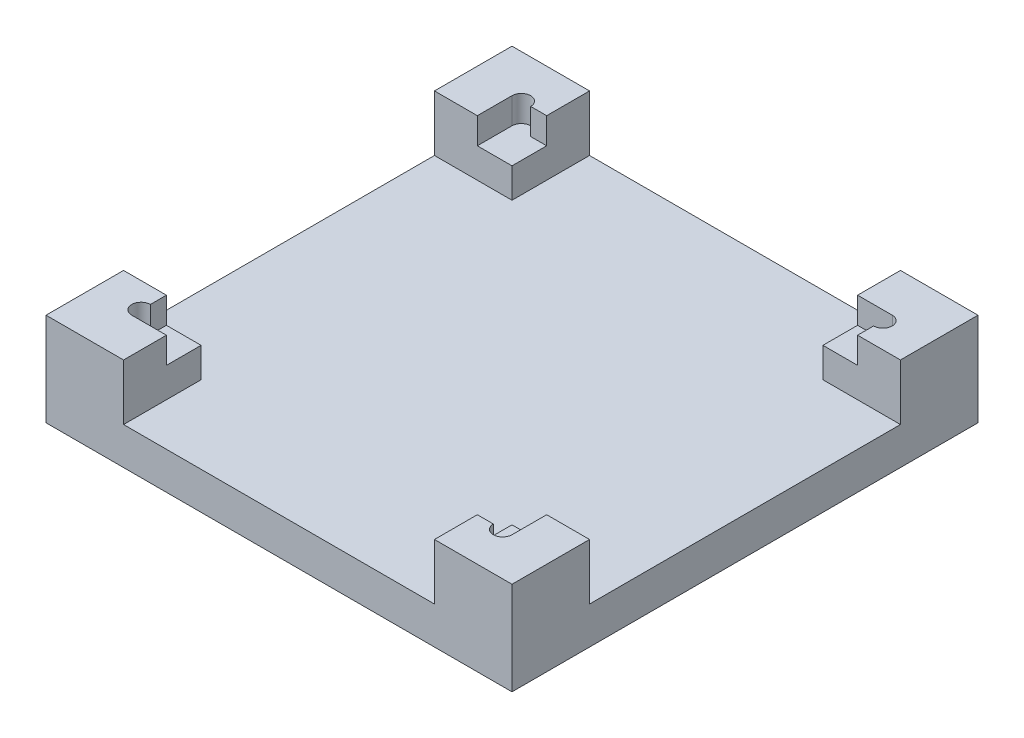
ISO-10303-21;
HEADER;
FILE_DESCRIPTION(('STEP AP214'),'2;1');
FILE_NAME('part.step','',(''),(''),'','','');
FILE_SCHEMA(('AUTOMOTIVE_DESIGN { 1 0 10303 214 1 1 1 1 }'));
ENDSEC;
DATA;
#1=APPLICATION_CONTEXT('core data for automotive mechanical design processes');
#2=APPLICATION_PROTOCOL_DEFINITION('international standard','automotive_design',2000,#1);
#3=PRODUCT_CONTEXT('',#1,'mechanical');
#4=PRODUCT('Part','Part','',(#3));
#5=PRODUCT_RELATED_PRODUCT_CATEGORY('part','',(#4));
#6=PRODUCT_DEFINITION_FORMATION('','',#4);
#7=PRODUCT_DEFINITION_CONTEXT('part definition',#1,'design');
#8=PRODUCT_DEFINITION('design','',#6,#7);
#9=PRODUCT_DEFINITION_SHAPE('','',#8);
#10=(LENGTH_UNIT() NAMED_UNIT(*) SI_UNIT(.MILLI.,.METRE.));
#11=(NAMED_UNIT(*) PLANE_ANGLE_UNIT() SI_UNIT($,.RADIAN.));
#12=(NAMED_UNIT(*) SI_UNIT($,.STERADIAN.) SOLID_ANGLE_UNIT());
#13=UNCERTAINTY_MEASURE_WITH_UNIT(LENGTH_MEASURE(1.E-05),#10,'distance_accuracy_value','');
#14=(GEOMETRIC_REPRESENTATION_CONTEXT(3) GLOBAL_UNCERTAINTY_ASSIGNED_CONTEXT((#13)) GLOBAL_UNIT_ASSIGNED_CONTEXT((#10,
#11,#12)) REPRESENTATION_CONTEXT('',''));
#15=CARTESIAN_POINT('',(0.,0.,0.));
#16=DIRECTION('',(0.,0.,1.));
#17=DIRECTION('',(1.,0.,0.));
#18=AXIS2_PLACEMENT_3D('',#15,#16,#17);
#19=CARTESIAN_POINT('',(0.,10.,0.));
#20=DIRECTION('',(0.,-1.,0.));
#21=DIRECTION('',(0.,0.,-1.));
#22=AXIS2_PLACEMENT_3D('',#19,#20,#21);
#23=PLANE('',#22);
#24=DIRECTION('',(-1.,0.,0.));
#25=VECTOR('',#24,1.);
#26=CARTESIAN_POINT('',(125.,10.,-104.2));
#27=LINE('',#26,#25);
#28=CARTESIAN_POINT('',(125.,10.,-104.2));
#29=VERTEX_POINT('',#28);
#30=CARTESIAN_POINT('',(104.2,10.,-104.2));
#31=VERTEX_POINT('',#30);
#32=EDGE_CURVE('E414',#29,#31,#27,.T.);
#33=ORIENTED_EDGE('',*,*,#32,.T.);
#34=DIRECTION('',(0.,0.,-1.));
#35=VECTOR('',#34,1.);
#36=CARTESIAN_POINT('',(104.2,10.,-125.));
#37=LINE('',#36,#35);
#38=CARTESIAN_POINT('',(104.2,10.,-125.));
#39=VERTEX_POINT('',#38);
#40=EDGE_CURVE('E442',#31,#39,#37,.T.);
#41=ORIENTED_EDGE('',*,*,#40,.T.);
#42=DIRECTION('',(-1.,0.,0.));
#43=VECTOR('',#42,1.);
#44=CARTESIAN_POINT('',(104.2,10.,-125.));
#45=LINE('',#44,#43);
#46=CARTESIAN_POINT('',(20.8,10.,-125.));
#47=VERTEX_POINT('',#46);
#48=EDGE_CURVE('E358',#39,#47,#45,.T.);
#49=ORIENTED_EDGE('',*,*,#48,.T.);
#50=DIRECTION('',(0.,0.,1.));
#51=VECTOR('',#50,1.);
#52=CARTESIAN_POINT('',(20.8,10.,-125.));
#53=LINE('',#52,#51);
#54=CARTESIAN_POINT('',(20.8,10.,-104.2));
#55=VERTEX_POINT('',#54);
#56=EDGE_CURVE('E365',#47,#55,#53,.T.);
#57=ORIENTED_EDGE('',*,*,#56,.T.);
#58=DIRECTION('',(-1.,0.,0.));
#59=VECTOR('',#58,1.);
#60=CARTESIAN_POINT('',(11.5,10.,-104.2));
#61=LINE('',#60,#59);
#62=CARTESIAN_POINT('',(0.,10.,-104.2));
#63=VERTEX_POINT('',#62);
#64=EDGE_CURVE('E55',#55,#63,#61,.T.);
#65=ORIENTED_EDGE('',*,*,#64,.T.);
#66=DIRECTION('',(0.,0.,1.));
#67=VECTOR('',#66,1.);
#68=CARTESIAN_POINT('',(0.,10.,-104.2));
#69=LINE('',#68,#67);
#70=CARTESIAN_POINT('',(0.,10.,-20.8));
#71=VERTEX_POINT('',#70);
#72=EDGE_CURVE('E370',#63,#71,#69,.T.);
#73=ORIENTED_EDGE('',*,*,#72,.T.);
#74=DIRECTION('',(1.,0.,0.));
#75=VECTOR('',#74,1.);
#76=CARTESIAN_POINT('',(11.5,10.,-20.8));
#77=LINE('',#76,#75);
#78=CARTESIAN_POINT('',(20.8,10.,-20.8));
#79=VERTEX_POINT('',#78);
#80=EDGE_CURVE('E373',#71,#79,#77,.T.);
#81=ORIENTED_EDGE('',*,*,#80,.T.);
#82=DIRECTION('',(0.,0.,1.));
#83=VECTOR('',#82,1.);
#84=CARTESIAN_POINT('',(20.8,10.,-11.5));
#85=LINE('',#84,#83);
#86=CARTESIAN_POINT('',(20.8,10.,0.));
#87=VERTEX_POINT('',#86);
#88=EDGE_CURVE('E391',#79,#87,#85,.T.);
#89=ORIENTED_EDGE('',*,*,#88,.T.);
#90=DIRECTION('',(1.,0.,0.));
#91=VECTOR('',#90,1.);
#92=CARTESIAN_POINT('',(104.2,10.,0.));
#93=LINE('',#92,#91);
#94=CARTESIAN_POINT('',(104.2,10.,0.));
#95=VERTEX_POINT('',#94);
#96=EDGE_CURVE('E395',#87,#95,#93,.T.);
#97=ORIENTED_EDGE('',*,*,#96,.T.);
#98=DIRECTION('',(0.,0.,-1.));
#99=VECTOR('',#98,1.);
#100=CARTESIAN_POINT('',(104.2,10.,-11.5));
#101=LINE('',#100,#99);
#102=CARTESIAN_POINT('',(104.2,10.,-20.8));
#103=VERTEX_POINT('',#102);
#104=EDGE_CURVE('E388',#95,#103,#101,.T.);
#105=ORIENTED_EDGE('',*,*,#104,.T.);
#106=DIRECTION('',(1.,0.,0.));
#107=VECTOR('',#106,1.);
#108=CARTESIAN_POINT('',(125.,10.,-20.8));
#109=LINE('',#108,#107);
#110=CARTESIAN_POINT('',(125.,10.,-20.8));
#111=VERTEX_POINT('',#110);
#112=EDGE_CURVE('E416',#103,#111,#109,.T.);
#113=ORIENTED_EDGE('',*,*,#112,.T.);
#114=DIRECTION('',(0.,0.,-1.));
#115=VECTOR('',#114,1.);
#116=CARTESIAN_POINT('',(125.,10.,-104.2));
#117=LINE('',#116,#115);
#118=EDGE_CURVE('E411',#111,#29,#117,.T.);
#119=ORIENTED_EDGE('',*,*,#118,.T.);
#120=EDGE_LOOP('',(#33,#41,#49,#57,#65,#73,#81,#89,#97,#105,#113,#119));
#121=FACE_BOUND('',#120,.T.);
#122=ADVANCED_FACE('F32',(#121),#23,.F.);
#123=CARTESIAN_POINT('',(11.5,10.,-113.5));
#124=DIRECTION('',(0.,0.,-1.));
#125=DIRECTION('',(-1.,0.,0.));
#126=AXIS2_PLACEMENT_3D('',#123,#124,#125);
#127=PLANE('',#126);
#128=DIRECTION('',(-1.,0.,0.));
#129=VECTOR('',#128,1.);
#130=CARTESIAN_POINT('',(113.5,18.,-113.5));
#131=LINE('',#130,#129);
#132=CARTESIAN_POINT('',(113.5,18.,-113.5));
#133=VERTEX_POINT('',#132);
#134=CARTESIAN_POINT('',(104.2,18.,-113.5));
#135=VERTEX_POINT('',#134);
#136=EDGE_CURVE('E493',#133,#135,#131,.T.);
#137=ORIENTED_EDGE('',*,*,#136,.F.);
#138=DIRECTION('',(0.,1.,0.));
#139=VECTOR('',#138,1.);
#140=CARTESIAN_POINT('',(113.5,10.,-113.5));
#141=LINE('',#140,#139);
#142=CARTESIAN_POINT('',(113.5,25.,-113.5));
#143=VERTEX_POINT('',#142);
#144=EDGE_CURVE('E261',#133,#143,#141,.T.);
#145=ORIENTED_EDGE('',*,*,#144,.T.);
#146=DIRECTION('',(-1.,0.,0.));
#147=VECTOR('',#146,1.);
#148=CARTESIAN_POINT('',(11.5,25.,-113.5));
#149=LINE('',#148,#147);
#150=CARTESIAN_POINT('',(104.2,25.,-113.5));
#151=VERTEX_POINT('',#150);
#152=EDGE_CURVE('E272',#143,#151,#149,.T.);
#153=ORIENTED_EDGE('',*,*,#152,.T.);
#154=DIRECTION('',(0.,1.,0.));
#155=VECTOR('',#154,1.);
#156=CARTESIAN_POINT('',(104.2,10.,-113.5));
#157=LINE('',#156,#155);
#158=EDGE_CURVE('E363',#135,#151,#157,.T.);
#159=ORIENTED_EDGE('',*,*,#158,.F.);
#160=EDGE_LOOP('',(#137,#145,#153,#159));
#161=FACE_BOUND('',#160,.T.);
#162=ADVANCED_FACE('F571',(#161),#127,.F.);
#163=CARTESIAN_POINT('',(113.5,10.,-11.5));
#164=DIRECTION('',(1.,0.,0.));
#165=DIRECTION('',(0.,0.,-1.));
#166=AXIS2_PLACEMENT_3D('',#163,#164,#165);
#167=PLANE('',#166);
#168=DIRECTION('',(0.,0.,-1.));
#169=VECTOR('',#168,1.);
#170=CARTESIAN_POINT('',(113.5,25.,-11.5));
#171=LINE('',#170,#169);
#172=CARTESIAN_POINT('',(113.5,25.,-104.2));
#173=VERTEX_POINT('',#172);
#174=CARTESIAN_POINT('',(113.5,25.,-108.5));
#175=VERTEX_POINT('',#174);
#176=EDGE_CURVE('E269',#173,#175,#171,.T.);
#177=ORIENTED_EDGE('',*,*,#176,.T.);
#178=DIRECTION('',(0.,1.,0.));
#179=VECTOR('',#178,1.);
#180=CARTESIAN_POINT('',(113.5,12.4098300562505,-108.5));
#181=LINE('',#180,#179);
#182=CARTESIAN_POINT('',(113.5,18.,-108.5));
#183=VERTEX_POINT('',#182);
#184=EDGE_CURVE('E512',#183,#175,#181,.T.);
#185=ORIENTED_EDGE('',*,*,#184,.F.);
#186=DIRECTION('',(0.,0.,-1.));
#187=VECTOR('',#186,1.);
#188=CARTESIAN_POINT('',(113.5,18.,-113.5));
#189=LINE('',#188,#187);
#190=CARTESIAN_POINT('',(113.5,18.,-104.2));
#191=VERTEX_POINT('',#190);
#192=EDGE_CURVE('E495',#191,#183,#189,.T.);
#193=ORIENTED_EDGE('',*,*,#192,.F.);
#194=DIRECTION('',(0.,1.,0.));
#195=VECTOR('',#194,1.);
#196=CARTESIAN_POINT('',(113.5,10.,-104.2));
#197=LINE('',#196,#195);
#198=EDGE_CURVE('E428',#191,#173,#197,.T.);
#199=ORIENTED_EDGE('',*,*,#198,.T.);
#200=EDGE_LOOP('',(#177,#185,#193,#199));
#201=FACE_BOUND('',#200,.T.);
#202=ADVANCED_FACE('F576',(#201),#167,.F.);
#203=CARTESIAN_POINT('',(11.5,10.,-11.5));
#204=DIRECTION('',(-1.,0.,0.));
#205=DIRECTION('',(0.,0.,1.));
#206=AXIS2_PLACEMENT_3D('',#203,#204,#205);
#207=PLANE('',#206);
#208=DIRECTION('',(0.,0.,1.));
#209=VECTOR('',#208,1.);
#210=CARTESIAN_POINT('',(11.5,25.,-11.5));
#211=LINE('',#210,#209);
#212=CARTESIAN_POINT('',(11.5,25.,-20.8));
#213=VERTEX_POINT('',#212);
#214=CARTESIAN_POINT('',(11.5,25.,-16.5));
#215=VERTEX_POINT('',#214);
#216=EDGE_CURVE('E432',#213,#215,#211,.T.);
#217=ORIENTED_EDGE('',*,*,#216,.T.);
#218=DIRECTION('',(0.,1.,0.));
#219=VECTOR('',#218,1.);
#220=CARTESIAN_POINT('',(11.5,12.4098300562505,-16.5));
#221=LINE('',#220,#219);
#222=CARTESIAN_POINT('',(11.5,18.,-16.5));
#223=VERTEX_POINT('',#222);
#224=EDGE_CURVE('E499',#223,#215,#221,.T.);
#225=ORIENTED_EDGE('',*,*,#224,.F.);
#226=DIRECTION('',(0.,0.,1.));
#227=VECTOR('',#226,1.);
#228=CARTESIAN_POINT('',(11.5,18.,-11.5));
#229=LINE('',#228,#227);
#230=CARTESIAN_POINT('',(11.5,18.,-20.8));
#231=VERTEX_POINT('',#230);
#232=EDGE_CURVE('E470',#231,#223,#229,.T.);
#233=ORIENTED_EDGE('',*,*,#232,.F.);
#234=DIRECTION('',(0.,1.,0.));
#235=VECTOR('',#234,1.);
#236=CARTESIAN_POINT('',(11.5,10.,-20.8));
#237=LINE('',#236,#235);
#238=EDGE_CURVE('E381',#231,#213,#237,.T.);
#239=ORIENTED_EDGE('',*,*,#238,.T.);
#240=EDGE_LOOP('',(#217,#225,#233,#239));
#241=FACE_BOUND('',#240,.T.);
#242=ADVANCED_FACE('F554',(#241),#207,.F.);
#243=CARTESIAN_POINT('',(11.5,10.,-11.5));
#244=DIRECTION('',(0.,0.,1.));
#245=DIRECTION('',(1.,0.,0.));
#246=AXIS2_PLACEMENT_3D('',#243,#244,#245);
#247=PLANE('',#246);
#248=DIRECTION('',(1.,0.,0.));
#249=VECTOR('',#248,1.);
#250=CARTESIAN_POINT('',(11.5,18.,-11.5));
#251=LINE('',#250,#249);
#252=CARTESIAN_POINT('',(11.5,18.,-11.5));
#253=VERTEX_POINT('',#252);
#254=CARTESIAN_POINT('',(20.8,18.,-11.5));
#255=VERTEX_POINT('',#254);
#256=EDGE_CURVE('E467',#253,#255,#251,.T.);
#257=ORIENTED_EDGE('',*,*,#256,.F.);
#258=DIRECTION('',(0.,1.,0.));
#259=VECTOR('',#258,1.);
#260=CARTESIAN_POINT('',(11.5,10.,-11.5));
#261=LINE('',#260,#259);
#262=CARTESIAN_POINT('',(11.5,25.,-11.5));
#263=VERTEX_POINT('',#262);
#264=EDGE_CURVE('E262',#253,#263,#261,.T.);
#265=ORIENTED_EDGE('',*,*,#264,.T.);
#266=DIRECTION('',(1.,0.,0.));
#267=VECTOR('',#266,1.);
#268=CARTESIAN_POINT('',(11.5,25.,-11.5));
#269=LINE('',#268,#267);
#270=CARTESIAN_POINT('',(20.8,25.,-11.5));
#271=VERTEX_POINT('',#270);
#272=EDGE_CURVE('E275',#263,#271,#269,.T.);
#273=ORIENTED_EDGE('',*,*,#272,.T.);
#274=DIRECTION('',(0.,1.,0.));
#275=VECTOR('',#274,1.);
#276=CARTESIAN_POINT('',(20.8,10.,-11.5));
#277=LINE('',#276,#275);
#278=EDGE_CURVE('E408',#255,#271,#277,.T.);
#279=ORIENTED_EDGE('',*,*,#278,.F.);
#280=EDGE_LOOP('',(#257,#265,#273,#279));
#281=FACE_BOUND('',#280,.T.);
#282=ADVANCED_FACE('F547',(#281),#247,.F.);
#283=CARTESIAN_POINT('',(0.,25.,0.));
#284=DIRECTION('',(0.,-1.,0.));
#285=DIRECTION('',(0.,0.,-1.));
#286=AXIS2_PLACEMENT_3D('',#283,#284,#285);
#287=PLANE('',#286);
#288=ORIENTED_EDGE('',*,*,#152,.F.);
#289=CARTESIAN_POINT('',(113.5,25.,-111.));
#290=DIRECTION('',(0.,1.,0.));
#291=DIRECTION('',(0.,0.,-1.));
#292=AXIS2_PLACEMENT_3D('',#289,#290,#291);
#293=CIRCLE('',#292,2.5);
#294=EDGE_CURVE('E511',#175,#143,#293,.T.);
#295=ORIENTED_EDGE('',*,*,#294,.F.);
#296=ORIENTED_EDGE('',*,*,#176,.F.);
#297=DIRECTION('',(-1.,0.,0.));
#298=VECTOR('',#297,1.);
#299=CARTESIAN_POINT('',(125.,25.,-104.2));
#300=LINE('',#299,#298);
#301=CARTESIAN_POINT('',(125.,25.,-104.2));
#302=VERTEX_POINT('',#301);
#303=EDGE_CURVE('E420',#302,#173,#300,.T.);
#304=ORIENTED_EDGE('',*,*,#303,.F.);
#305=DIRECTION('',(0.,0.,-1.));
#306=VECTOR('',#305,1.);
#307=CARTESIAN_POINT('',(125.,25.,0.));
#308=LINE('',#307,#306);
#309=CARTESIAN_POINT('',(125.,25.,-125.));
#310=VERTEX_POINT('',#309);
#311=EDGE_CURVE('E296',#302,#310,#308,.T.);
#312=ORIENTED_EDGE('',*,*,#311,.T.);
#313=DIRECTION('',(-1.,0.,0.));
#314=VECTOR('',#313,1.);
#315=CARTESIAN_POINT('',(0.,25.,-125.));
#316=LINE('',#315,#314);
#317=CARTESIAN_POINT('',(104.2,25.,-125.));
#318=VERTEX_POINT('',#317);
#319=EDGE_CURVE('E300',#310,#318,#316,.T.);
#320=ORIENTED_EDGE('',*,*,#319,.T.);
#321=DIRECTION('',(0.,0.,-1.));
#322=VECTOR('',#321,1.);
#323=CARTESIAN_POINT('',(104.2,25.,-125.));
#324=LINE('',#323,#322);
#325=EDGE_CURVE('E383',#151,#318,#324,.T.);
#326=ORIENTED_EDGE('',*,*,#325,.F.);
#327=EDGE_LOOP('',(#288,#295,#296,#304,#312,#320,#326));
#328=FACE_BOUND('',#327,.T.);
#329=ADVANCED_FACE('F593',(#328),#287,.F.);
#330=ORIENTED_EDGE('',*,*,#272,.F.);
#331=CARTESIAN_POINT('',(11.5,25.,-14.));
#332=DIRECTION('',(0.,1.,0.));
#333=DIRECTION('',(0.,0.,-1.));
#334=AXIS2_PLACEMENT_3D('',#331,#332,#333);
#335=CIRCLE('',#334,2.5);
#336=EDGE_CURVE('E501',#215,#263,#335,.T.);
#337=ORIENTED_EDGE('',*,*,#336,.F.);
#338=ORIENTED_EDGE('',*,*,#216,.F.);
#339=DIRECTION('',(1.,0.,0.));
#340=VECTOR('',#339,1.);
#341=CARTESIAN_POINT('',(11.5,25.,-20.8));
#342=LINE('',#341,#340);
#343=CARTESIAN_POINT('',(0.,25.,-20.8));
#344=VERTEX_POINT('',#343);
#345=EDGE_CURVE('E371',#344,#213,#342,.T.);
#346=ORIENTED_EDGE('',*,*,#345,.F.);
#347=DIRECTION('',(0.,0.,1.));
#348=VECTOR('',#347,1.);
#349=CARTESIAN_POINT('',(0.,25.,0.));
#350=LINE('',#349,#348);
#351=CARTESIAN_POINT('',(0.,25.,0.));
#352=VERTEX_POINT('',#351);
#353=EDGE_CURVE('E292',#344,#352,#350,.T.);
#354=ORIENTED_EDGE('',*,*,#353,.T.);
#355=DIRECTION('',(1.,0.,0.));
#356=VECTOR('',#355,1.);
#357=CARTESIAN_POINT('',(0.,25.,0.));
#358=LINE('',#357,#356);
#359=CARTESIAN_POINT('',(20.8,25.,0.));
#360=VERTEX_POINT('',#359);
#361=EDGE_CURVE('E293',#352,#360,#358,.T.);
#362=ORIENTED_EDGE('',*,*,#361,.T.);
#363=DIRECTION('',(0.,0.,1.));
#364=VECTOR('',#363,1.);
#365=CARTESIAN_POINT('',(20.8,25.,-11.5));
#366=LINE('',#365,#364);
#367=EDGE_CURVE('E392',#271,#360,#366,.T.);
#368=ORIENTED_EDGE('',*,*,#367,.F.);
#369=EDGE_LOOP('',(#330,#337,#338,#346,#354,#362,#368));
#370=FACE_BOUND('',#369,.T.);
#371=ADVANCED_FACE('F543',(#370),#287,.F.);
#372=CARTESIAN_POINT('',(113.5,25.,-11.5));
#373=VERTEX_POINT('',#372);
#374=CARTESIAN_POINT('',(113.5,25.,-20.8));
#375=VERTEX_POINT('',#374);
#376=EDGE_CURVE('E258',#373,#375,#171,.T.);
#377=ORIENTED_EDGE('',*,*,#376,.F.);
#378=CARTESIAN_POINT('',(111.,25.,-11.5));
#379=DIRECTION('',(0.,1.,0.));
#380=DIRECTION('',(0.,0.,-1.));
#381=AXIS2_PLACEMENT_3D('',#378,#379,#380);
#382=CIRCLE('',#381,2.5);
#383=CARTESIAN_POINT('',(108.5,25.,-11.5));
#384=VERTEX_POINT('',#383);
#385=EDGE_CURVE('E241',#384,#373,#382,.T.);
#386=ORIENTED_EDGE('',*,*,#385,.F.);
#387=CARTESIAN_POINT('',(104.2,25.,-11.5));
#388=VERTEX_POINT('',#387);
#389=EDGE_CURVE('E431',#388,#384,#269,.T.);
#390=ORIENTED_EDGE('',*,*,#389,.F.);
#391=DIRECTION('',(0.,0.,-1.));
#392=VECTOR('',#391,1.);
#393=CARTESIAN_POINT('',(104.2,25.,-11.5));
#394=LINE('',#393,#392);
#395=CARTESIAN_POINT('',(104.2,25.,0.));
#396=VERTEX_POINT('',#395);
#397=EDGE_CURVE('E399',#396,#388,#394,.T.);
#398=ORIENTED_EDGE('',*,*,#397,.F.);
#399=CARTESIAN_POINT('',(125.,25.,0.));
#400=VERTEX_POINT('',#399);
#401=EDGE_CURVE('E291',#396,#400,#358,.T.);
#402=ORIENTED_EDGE('',*,*,#401,.T.);
#403=CARTESIAN_POINT('',(125.,25.,-20.8));
#404=VERTEX_POINT('',#403);
#405=EDGE_CURVE('E297',#400,#404,#308,.T.);
#406=ORIENTED_EDGE('',*,*,#405,.T.);
#407=DIRECTION('',(1.,0.,0.));
#408=VECTOR('',#407,1.);
#409=CARTESIAN_POINT('',(125.,25.,-20.8));
#410=LINE('',#409,#408);
#411=EDGE_CURVE('E267',#375,#404,#410,.T.);
#412=ORIENTED_EDGE('',*,*,#411,.F.);
#413=EDGE_LOOP('',(#377,#386,#390,#398,#402,#406,#412));
#414=FACE_BOUND('',#413,.T.);
#415=ADVANCED_FACE('F265',(#414),#287,.F.);
#416=DIRECTION('',(0.,1.,0.));
#417=VECTOR('',#416,1.);
#418=CARTESIAN_POINT('',(113.5,10.,-20.8));
#419=LINE('',#418,#417);
#420=CARTESIAN_POINT('',(113.5,18.,-20.8));
#421=VERTEX_POINT('',#420);
#422=EDGE_CURVE('E426',#421,#375,#419,.T.);
#423=ORIENTED_EDGE('',*,*,#422,.F.);
#424=DIRECTION('',(0.,0.,-1.));
#425=VECTOR('',#424,1.);
#426=CARTESIAN_POINT('',(113.5,18.,-11.5));
#427=LINE('',#426,#425);
#428=CARTESIAN_POINT('',(113.5,18.,-11.5));
#429=VERTEX_POINT('',#428);
#430=EDGE_CURVE('E260',#429,#421,#427,.T.);
#431=ORIENTED_EDGE('',*,*,#430,.F.);
#432=DIRECTION('',(0.,1.,0.));
#433=VECTOR('',#432,1.);
#434=CARTESIAN_POINT('',(113.5,10.,-11.5));
#435=LINE('',#434,#433);
#436=EDGE_CURVE('E244',#429,#373,#435,.T.);
#437=ORIENTED_EDGE('',*,*,#436,.T.);
#438=ORIENTED_EDGE('',*,*,#376,.T.);
#439=EDGE_LOOP('',(#423,#431,#437,#438));
#440=FACE_BOUND('',#439,.T.);
#441=ADVANCED_FACE('F257',(#440),#167,.F.);
#442=ORIENTED_EDGE('',*,*,#389,.T.);
#443=DIRECTION('',(0.,1.,0.));
#444=VECTOR('',#443,1.);
#445=CARTESIAN_POINT('',(108.5,12.4098300562505,-11.5));
#446=LINE('',#445,#444);
#447=CARTESIAN_POINT('',(108.5,18.,-11.5));
#448=VERTEX_POINT('',#447);
#449=EDGE_CURVE('E247',#448,#384,#446,.T.);
#450=ORIENTED_EDGE('',*,*,#449,.F.);
#451=DIRECTION('',(1.,0.,0.));
#452=VECTOR('',#451,1.);
#453=CARTESIAN_POINT('',(113.5,18.,-11.5));
#454=LINE('',#453,#452);
#455=CARTESIAN_POINT('',(104.2,18.,-11.5));
#456=VERTEX_POINT('',#455);
#457=EDGE_CURVE('E450',#456,#448,#454,.T.);
#458=ORIENTED_EDGE('',*,*,#457,.F.);
#459=DIRECTION('',(0.,1.,0.));
#460=VECTOR('',#459,1.);
#461=CARTESIAN_POINT('',(104.2,10.,-11.5));
#462=LINE('',#461,#460);
#463=EDGE_CURVE('E398',#456,#388,#462,.T.);
#464=ORIENTED_EDGE('',*,*,#463,.T.);
#465=EDGE_LOOP('',(#442,#450,#458,#464));
#466=FACE_BOUND('',#465,.T.);
#467=ADVANCED_FACE('F520',(#466),#247,.F.);
#468=CARTESIAN_POINT('',(0.,25.,0.));
#469=DIRECTION('',(1.,0.,0.));
#470=DIRECTION('',(0.,0.,-1.));
#471=AXIS2_PLACEMENT_3D('',#468,#469,#470);
#472=PLANE('',#471);
#473=ORIENTED_EDGE('',*,*,#353,.F.);
#474=DIRECTION('',(0.,1.,0.));
#475=VECTOR('',#474,1.);
#476=CARTESIAN_POINT('',(0.,10.,-20.8));
#477=LINE('',#476,#475);
#478=EDGE_CURVE('E384',#71,#344,#477,.T.);
#479=ORIENTED_EDGE('',*,*,#478,.F.);
#480=ORIENTED_EDGE('',*,*,#72,.F.);
#481=DIRECTION('',(0.,1.,0.));
#482=VECTOR('',#481,1.);
#483=CARTESIAN_POINT('',(0.,10.,-104.2));
#484=LINE('',#483,#482);
#485=CARTESIAN_POINT('',(0.,25.,-104.2));
#486=VERTEX_POINT('',#485);
#487=EDGE_CURVE('E343',#63,#486,#484,.T.);
#488=ORIENTED_EDGE('',*,*,#487,.T.);
#489=CARTESIAN_POINT('',(0.,25.,-125.));
#490=VERTEX_POINT('',#489);
#491=EDGE_CURVE('E288',#490,#486,#350,.T.);
#492=ORIENTED_EDGE('',*,*,#491,.F.);
#493=DIRECTION('',(0.,-1.,0.));
#494=VECTOR('',#493,1.);
#495=CARTESIAN_POINT('',(0.,25.,-125.));
#496=LINE('',#495,#494);
#497=CARTESIAN_POINT('',(0.,0.,-125.));
#498=VERTEX_POINT('',#497);
#499=EDGE_CURVE('E303',#490,#498,#496,.T.);
#500=ORIENTED_EDGE('',*,*,#499,.T.);
#501=DIRECTION('',(0.,0.,1.));
#502=VECTOR('',#501,1.);
#503=CARTESIAN_POINT('',(0.,0.,0.));
#504=LINE('',#503,#502);
#505=CARTESIAN_POINT('',(0.,0.,0.));
#506=VERTEX_POINT('',#505);
#507=EDGE_CURVE('E283',#498,#506,#504,.T.);
#508=ORIENTED_EDGE('',*,*,#507,.T.);
#509=DIRECTION('',(0.,-1.,0.));
#510=VECTOR('',#509,1.);
#511=CARTESIAN_POINT('',(0.,25.,0.));
#512=LINE('',#511,#510);
#513=EDGE_CURVE('E11',#352,#506,#512,.T.);
#514=ORIENTED_EDGE('',*,*,#513,.F.);
#515=EDGE_LOOP('',(#473,#479,#480,#488,#492,#500,#508,#514));
#516=FACE_BOUND('',#515,.T.);
#517=ADVANCED_FACE('F34',(#516),#472,.F.);
#518=CARTESIAN_POINT('',(0.,25.,0.));
#519=DIRECTION('',(0.,0.,-1.));
#520=DIRECTION('',(-1.,0.,0.));
#521=AXIS2_PLACEMENT_3D('',#518,#519,#520);
#522=PLANE('',#521);
#523=ORIENTED_EDGE('',*,*,#401,.F.);
#524=DIRECTION('',(0.,1.,0.));
#525=VECTOR('',#524,1.);
#526=CARTESIAN_POINT('',(104.2,10.,0.));
#527=LINE('',#526,#525);
#528=EDGE_CURVE('E378',#95,#396,#527,.T.);
#529=ORIENTED_EDGE('',*,*,#528,.F.);
#530=ORIENTED_EDGE('',*,*,#96,.F.);
#531=DIRECTION('',(0.,1.,0.));
#532=VECTOR('',#531,1.);
#533=CARTESIAN_POINT('',(20.8,10.,0.));
#534=LINE('',#533,#532);
#535=EDGE_CURVE('E405',#87,#360,#534,.T.);
#536=ORIENTED_EDGE('',*,*,#535,.T.);
#537=ORIENTED_EDGE('',*,*,#361,.F.);
#538=ORIENTED_EDGE('',*,*,#513,.T.);
#539=DIRECTION('',(1.,0.,0.));
#540=VECTOR('',#539,1.);
#541=CARTESIAN_POINT('',(0.,0.,0.));
#542=LINE('',#541,#540);
#543=CARTESIAN_POINT('',(125.,0.,0.));
#544=VERTEX_POINT('',#543);
#545=EDGE_CURVE('E306',#506,#544,#542,.T.);
#546=ORIENTED_EDGE('',*,*,#545,.T.);
#547=DIRECTION('',(0.,-1.,0.));
#548=VECTOR('',#547,1.);
#549=CARTESIAN_POINT('',(125.,25.,0.));
#550=LINE('',#549,#548);
#551=EDGE_CURVE('E40',#400,#544,#550,.T.);
#552=ORIENTED_EDGE('',*,*,#551,.F.);
#553=EDGE_LOOP('',(#523,#529,#530,#536,#537,#538,#546,#552));
#554=FACE_BOUND('',#553,.T.);
#555=ADVANCED_FACE('F529',(#554),#522,.F.);
#556=CARTESIAN_POINT('',(125.,25.,0.));
#557=DIRECTION('',(-1.,0.,0.));
#558=DIRECTION('',(0.,0.,1.));
#559=AXIS2_PLACEMENT_3D('',#556,#557,#558);
#560=PLANE('',#559);
#561=ORIENTED_EDGE('',*,*,#118,.F.);
#562=DIRECTION('',(0.,1.,0.));
#563=VECTOR('',#562,1.);
#564=CARTESIAN_POINT('',(125.,10.,-20.8));
#565=LINE('',#564,#563);
#566=EDGE_CURVE('E402',#111,#404,#565,.T.);
#567=ORIENTED_EDGE('',*,*,#566,.T.);
#568=ORIENTED_EDGE('',*,*,#405,.F.);
#569=ORIENTED_EDGE('',*,*,#551,.T.);
#570=DIRECTION('',(0.,0.,-1.));
#571=VECTOR('',#570,1.);
#572=CARTESIAN_POINT('',(125.,0.,0.));
#573=LINE('',#572,#571);
#574=CARTESIAN_POINT('',(125.,0.,-125.));
#575=VERTEX_POINT('',#574);
#576=EDGE_CURVE('E308',#544,#575,#573,.T.);
#577=ORIENTED_EDGE('',*,*,#576,.T.);
#578=DIRECTION('',(0.,-1.,0.));
#579=VECTOR('',#578,1.);
#580=CARTESIAN_POINT('',(125.,25.,-125.));
#581=LINE('',#580,#579);
#582=EDGE_CURVE('E314',#310,#575,#581,.T.);
#583=ORIENTED_EDGE('',*,*,#582,.F.);
#584=ORIENTED_EDGE('',*,*,#311,.F.);
#585=DIRECTION('',(0.,1.,0.));
#586=VECTOR('',#585,1.);
#587=CARTESIAN_POINT('',(125.,10.,-104.2));
#588=LINE('',#587,#586);
#589=EDGE_CURVE('E419',#29,#302,#588,.T.);
#590=ORIENTED_EDGE('',*,*,#589,.F.);
#591=EDGE_LOOP('',(#561,#567,#568,#569,#577,#583,#584,#590));
#592=FACE_BOUND('',#591,.T.);
#593=ADVANCED_FACE('F322',(#592),#560,.F.);
#594=CARTESIAN_POINT('',(0.,25.,-125.));
#595=DIRECTION('',(0.,0.,1.));
#596=DIRECTION('',(1.,0.,0.));
#597=AXIS2_PLACEMENT_3D('',#594,#595,#596);
#598=PLANE('',#597);
#599=ORIENTED_EDGE('',*,*,#48,.F.);
#600=DIRECTION('',(0.,1.,0.));
#601=VECTOR('',#600,1.);
#602=CARTESIAN_POINT('',(104.2,10.,-125.));
#603=LINE('',#602,#601);
#604=EDGE_CURVE('E361',#39,#318,#603,.T.);
#605=ORIENTED_EDGE('',*,*,#604,.T.);
#606=ORIENTED_EDGE('',*,*,#319,.F.);
#607=ORIENTED_EDGE('',*,*,#582,.T.);
#608=DIRECTION('',(-1.,0.,0.));
#609=VECTOR('',#608,1.);
#610=CARTESIAN_POINT('',(0.,0.,-125.));
#611=LINE('',#610,#609);
#612=EDGE_CURVE('E310',#575,#498,#611,.T.);
#613=ORIENTED_EDGE('',*,*,#612,.T.);
#614=ORIENTED_EDGE('',*,*,#499,.F.);
#615=CARTESIAN_POINT('',(20.8,25.,-125.));
#616=VERTEX_POINT('',#615);
#617=EDGE_CURVE('E299',#616,#490,#316,.T.);
#618=ORIENTED_EDGE('',*,*,#617,.F.);
#619=DIRECTION('',(0.,1.,0.));
#620=VECTOR('',#619,1.);
#621=CARTESIAN_POINT('',(20.8,10.,-125.));
#622=LINE('',#621,#620);
#623=EDGE_CURVE('E355',#47,#616,#622,.T.);
#624=ORIENTED_EDGE('',*,*,#623,.F.);
#625=EDGE_LOOP('',(#599,#605,#606,#607,#613,#614,#618,#624));
#626=FACE_BOUND('',#625,.T.);
#627=ADVANCED_FACE('F334',(#626),#598,.F.);
#628=CARTESIAN_POINT('',(11.5,25.,-113.5));
#629=VERTEX_POINT('',#628);
#630=CARTESIAN_POINT('',(11.5,25.,-104.2));
#631=VERTEX_POINT('',#630);
#632=EDGE_CURVE('E430',#629,#631,#211,.T.);
#633=ORIENTED_EDGE('',*,*,#632,.F.);
#634=CARTESIAN_POINT('',(14.,25.,-113.5));
#635=DIRECTION('',(0.,1.,0.));
#636=DIRECTION('',(0.,0.,-1.));
#637=AXIS2_PLACEMENT_3D('',#634,#635,#636);
#638=CIRCLE('',#637,2.5);
#639=CARTESIAN_POINT('',(16.5,25.,-113.5));
#640=VERTEX_POINT('',#639);
#641=EDGE_CURVE('E508',#640,#629,#638,.T.);
#642=ORIENTED_EDGE('',*,*,#641,.F.);
#643=CARTESIAN_POINT('',(20.8,25.,-113.5));
#644=VERTEX_POINT('',#643);
#645=EDGE_CURVE('E268',#644,#640,#149,.T.);
#646=ORIENTED_EDGE('',*,*,#645,.F.);
#647=DIRECTION('',(0.,0.,1.));
#648=VECTOR('',#647,1.);
#649=CARTESIAN_POINT('',(20.8,25.,-125.));
#650=LINE('',#649,#648);
#651=EDGE_CURVE('E353',#616,#644,#650,.T.);
#652=ORIENTED_EDGE('',*,*,#651,.F.);
#653=ORIENTED_EDGE('',*,*,#617,.T.);
#654=ORIENTED_EDGE('',*,*,#491,.T.);
#655=DIRECTION('',(-1.,0.,0.));
#656=VECTOR('',#655,1.);
#657=CARTESIAN_POINT('',(11.5,25.,-104.2));
#658=LINE('',#657,#656);
#659=EDGE_CURVE('E348',#631,#486,#658,.T.);
#660=ORIENTED_EDGE('',*,*,#659,.F.);
#661=EDGE_LOOP('',(#633,#642,#646,#652,#653,#654,#660));
#662=FACE_BOUND('',#661,.T.);
#663=ADVANCED_FACE('F347',(#662),#287,.F.);
#664=CARTESIAN_POINT('',(0.,0.,0.));
#665=DIRECTION('',(0.,-1.,0.));
#666=DIRECTION('',(0.,0.,-1.));
#667=AXIS2_PLACEMENT_3D('',#664,#665,#666);
#668=PLANE('',#667);
#669=ORIENTED_EDGE('',*,*,#507,.F.);
#670=ORIENTED_EDGE('',*,*,#612,.F.);
#671=ORIENTED_EDGE('',*,*,#576,.F.);
#672=ORIENTED_EDGE('',*,*,#545,.F.);
#673=EDGE_LOOP('',(#669,#670,#671,#672));
#674=FACE_BOUND('',#673,.T.);
#675=ADVANCED_FACE('F330',(#674),#668,.T.);
#676=DIRECTION('',(0.,1.,0.));
#677=VECTOR('',#676,1.);
#678=CARTESIAN_POINT('',(11.5,10.,-104.2));
#679=LINE('',#678,#677);
#680=CARTESIAN_POINT('',(11.5,18.,-104.2));
#681=VERTEX_POINT('',#680);
#682=EDGE_CURVE('E376',#681,#631,#679,.T.);
#683=ORIENTED_EDGE('',*,*,#682,.F.);
#684=DIRECTION('',(0.,0.,1.));
#685=VECTOR('',#684,1.);
#686=CARTESIAN_POINT('',(11.5,18.,-113.5));
#687=LINE('',#686,#685);
#688=CARTESIAN_POINT('',(11.5,18.,-113.5));
#689=VERTEX_POINT('',#688);
#690=EDGE_CURVE('E484',#689,#681,#687,.T.);
#691=ORIENTED_EDGE('',*,*,#690,.F.);
#692=DIRECTION('',(0.,1.,0.));
#693=VECTOR('',#692,1.);
#694=CARTESIAN_POINT('',(11.5,10.,-113.5));
#695=LINE('',#694,#693);
#696=EDGE_CURVE('E280',#689,#629,#695,.T.);
#697=ORIENTED_EDGE('',*,*,#696,.T.);
#698=ORIENTED_EDGE('',*,*,#632,.T.);
#699=EDGE_LOOP('',(#683,#691,#697,#698));
#700=FACE_BOUND('',#699,.T.);
#701=ADVANCED_FACE('F586',(#700),#207,.F.);
#702=ORIENTED_EDGE('',*,*,#645,.T.);
#703=DIRECTION('',(0.,1.,0.));
#704=VECTOR('',#703,1.);
#705=CARTESIAN_POINT('',(16.5,12.4098300562505,-113.5));
#706=LINE('',#705,#704);
#707=CARTESIAN_POINT('',(16.5,18.,-113.5));
#708=VERTEX_POINT('',#707);
#709=EDGE_CURVE('E505',#708,#640,#706,.T.);
#710=ORIENTED_EDGE('',*,*,#709,.F.);
#711=DIRECTION('',(-1.,0.,0.));
#712=VECTOR('',#711,1.);
#713=CARTESIAN_POINT('',(11.5,18.,-113.5));
#714=LINE('',#713,#712);
#715=CARTESIAN_POINT('',(20.8,18.,-113.5));
#716=VERTEX_POINT('',#715);
#717=EDGE_CURVE('E476',#716,#708,#714,.T.);
#718=ORIENTED_EDGE('',*,*,#717,.F.);
#719=DIRECTION('',(0.,1.,0.));
#720=VECTOR('',#719,1.);
#721=CARTESIAN_POINT('',(20.8,10.,-113.5));
#722=LINE('',#721,#720);
#723=EDGE_CURVE('E360',#716,#644,#722,.T.);
#724=ORIENTED_EDGE('',*,*,#723,.T.);
#725=EDGE_LOOP('',(#702,#710,#718,#724));
#726=FACE_BOUND('',#725,.T.);
#727=ADVANCED_FACE('F579',(#726),#127,.F.);
#728=CARTESIAN_POINT('',(125.,10.,-20.8));
#729=DIRECTION('',(0.,0.,1.));
#730=DIRECTION('',(1.,0.,0.));
#731=AXIS2_PLACEMENT_3D('',#728,#729,#730);
#732=PLANE('',#731);
#733=ORIENTED_EDGE('',*,*,#411,.T.);
#734=ORIENTED_EDGE('',*,*,#566,.F.);
#735=ORIENTED_EDGE('',*,*,#112,.F.);
#736=DIRECTION('',(0.,-1.,0.));
#737=VECTOR('',#736,1.);
#738=CARTESIAN_POINT('',(104.2,18.,-20.8));
#739=LINE('',#738,#737);
#740=CARTESIAN_POINT('',(104.2,18.,-20.8));
#741=VERTEX_POINT('',#740);
#742=EDGE_CURVE('E423',#741,#103,#739,.T.);
#743=ORIENTED_EDGE('',*,*,#742,.F.);
#744=DIRECTION('',(-1.,0.,0.));
#745=VECTOR('',#744,1.);
#746=CARTESIAN_POINT('',(113.5,18.,-20.8));
#747=LINE('',#746,#745);
#748=EDGE_CURVE('E456',#421,#741,#747,.T.);
#749=ORIENTED_EDGE('',*,*,#748,.F.);
#750=ORIENTED_EDGE('',*,*,#422,.T.);
#751=EDGE_LOOP('',(#733,#734,#735,#743,#749,#750));
#752=FACE_BOUND('',#751,.T.);
#753=ADVANCED_FACE('F585',(#752),#732,.F.);
#754=CARTESIAN_POINT('',(125.,10.,-104.2));
#755=DIRECTION('',(0.,0.,-1.));
#756=DIRECTION('',(-1.,0.,0.));
#757=AXIS2_PLACEMENT_3D('',#754,#755,#756);
#758=PLANE('',#757);
#759=ORIENTED_EDGE('',*,*,#303,.T.);
#760=ORIENTED_EDGE('',*,*,#198,.F.);
#761=DIRECTION('',(1.,0.,0.));
#762=VECTOR('',#761,1.);
#763=CARTESIAN_POINT('',(113.5,18.,-104.2));
#764=LINE('',#763,#762);
#765=CARTESIAN_POINT('',(104.2,18.,-104.2));
#766=VERTEX_POINT('',#765);
#767=EDGE_CURVE('E490',#766,#191,#764,.T.);
#768=ORIENTED_EDGE('',*,*,#767,.F.);
#769=DIRECTION('',(0.,-1.,0.));
#770=VECTOR('',#769,1.);
#771=CARTESIAN_POINT('',(104.2,18.,-104.2));
#772=LINE('',#771,#770);
#773=EDGE_CURVE('E487',#766,#31,#772,.T.);
#774=ORIENTED_EDGE('',*,*,#773,.T.);
#775=ORIENTED_EDGE('',*,*,#32,.F.);
#776=ORIENTED_EDGE('',*,*,#589,.T.);
#777=EDGE_LOOP('',(#759,#760,#768,#774,#775,#776));
#778=FACE_BOUND('',#777,.T.);
#779=ADVANCED_FACE('F581',(#778),#758,.F.);
#780=CARTESIAN_POINT('',(104.2,10.,-11.5));
#781=DIRECTION('',(1.,0.,0.));
#782=DIRECTION('',(0.,0.,-1.));
#783=AXIS2_PLACEMENT_3D('',#780,#781,#782);
#784=PLANE('',#783);
#785=ORIENTED_EDGE('',*,*,#397,.T.);
#786=ORIENTED_EDGE('',*,*,#463,.F.);
#787=DIRECTION('',(0.,0.,1.));
#788=VECTOR('',#787,1.);
#789=CARTESIAN_POINT('',(104.2,18.,-11.5));
#790=LINE('',#789,#788);
#791=EDGE_CURVE('E453',#741,#456,#790,.T.);
#792=ORIENTED_EDGE('',*,*,#791,.F.);
#793=ORIENTED_EDGE('',*,*,#742,.T.);
#794=ORIENTED_EDGE('',*,*,#104,.F.);
#795=ORIENTED_EDGE('',*,*,#528,.T.);
#796=EDGE_LOOP('',(#785,#786,#792,#793,#794,#795));
#797=FACE_BOUND('',#796,.T.);
#798=ADVANCED_FACE('F526',(#797),#784,.F.);
#799=CARTESIAN_POINT('',(20.8,10.,-11.5));
#800=DIRECTION('',(-1.,0.,0.));
#801=DIRECTION('',(0.,0.,1.));
#802=AXIS2_PLACEMENT_3D('',#799,#800,#801);
#803=PLANE('',#802);
#804=ORIENTED_EDGE('',*,*,#367,.T.);
#805=ORIENTED_EDGE('',*,*,#535,.F.);
#806=ORIENTED_EDGE('',*,*,#88,.F.);
#807=DIRECTION('',(0.,-1.,0.));
#808=VECTOR('',#807,1.);
#809=CARTESIAN_POINT('',(20.8,18.,-20.8));
#810=LINE('',#809,#808);
#811=CARTESIAN_POINT('',(20.8,18.,-20.8));
#812=VERTEX_POINT('',#811);
#813=EDGE_CURVE('E459',#812,#79,#810,.T.);
#814=ORIENTED_EDGE('',*,*,#813,.F.);
#815=DIRECTION('',(0.,0.,-1.));
#816=VECTOR('',#815,1.);
#817=CARTESIAN_POINT('',(20.8,18.,-11.5));
#818=LINE('',#817,#816);
#819=EDGE_CURVE('E465',#255,#812,#818,.T.);
#820=ORIENTED_EDGE('',*,*,#819,.F.);
#821=ORIENTED_EDGE('',*,*,#278,.T.);
#822=EDGE_LOOP('',(#804,#805,#806,#814,#820,#821));
#823=FACE_BOUND('',#822,.T.);
#824=ADVANCED_FACE('F536',(#823),#803,.F.);
#825=CARTESIAN_POINT('',(11.5,10.,-20.8));
#826=DIRECTION('',(0.,0.,1.));
#827=DIRECTION('',(1.,0.,0.));
#828=AXIS2_PLACEMENT_3D('',#825,#826,#827);
#829=PLANE('',#828);
#830=ORIENTED_EDGE('',*,*,#345,.T.);
#831=ORIENTED_EDGE('',*,*,#238,.F.);
#832=DIRECTION('',(-1.,0.,0.));
#833=VECTOR('',#832,1.);
#834=CARTESIAN_POINT('',(11.5,18.,-20.8));
#835=LINE('',#834,#833);
#836=EDGE_CURVE('E462',#812,#231,#835,.T.);
#837=ORIENTED_EDGE('',*,*,#836,.F.);
#838=ORIENTED_EDGE('',*,*,#813,.T.);
#839=ORIENTED_EDGE('',*,*,#80,.F.);
#840=ORIENTED_EDGE('',*,*,#478,.T.);
#841=EDGE_LOOP('',(#830,#831,#837,#838,#839,#840));
#842=FACE_BOUND('',#841,.T.);
#843=ADVANCED_FACE('F558',(#842),#829,.F.);
#844=CARTESIAN_POINT('',(11.5,10.,-104.2));
#845=DIRECTION('',(0.,0.,-1.));
#846=DIRECTION('',(-1.,0.,0.));
#847=AXIS2_PLACEMENT_3D('',#844,#845,#846);
#848=PLANE('',#847);
#849=ORIENTED_EDGE('',*,*,#659,.T.);
#850=ORIENTED_EDGE('',*,*,#487,.F.);
#851=ORIENTED_EDGE('',*,*,#64,.F.);
#852=DIRECTION('',(0.,-1.,0.));
#853=VECTOR('',#852,1.);
#854=CARTESIAN_POINT('',(20.8,18.,-104.2));
#855=LINE('',#854,#853);
#856=CARTESIAN_POINT('',(20.8,18.,-104.2));
#857=VERTEX_POINT('',#856);
#858=EDGE_CURVE('E473',#857,#55,#855,.T.);
#859=ORIENTED_EDGE('',*,*,#858,.F.);
#860=DIRECTION('',(1.,0.,0.));
#861=VECTOR('',#860,1.);
#862=CARTESIAN_POINT('',(11.5,18.,-104.2));
#863=LINE('',#862,#861);
#864=EDGE_CURVE('E482',#681,#857,#863,.T.);
#865=ORIENTED_EDGE('',*,*,#864,.F.);
#866=ORIENTED_EDGE('',*,*,#682,.T.);
#867=EDGE_LOOP('',(#849,#850,#851,#859,#865,#866));
#868=FACE_BOUND('',#867,.T.);
#869=ADVANCED_FACE('F560',(#868),#848,.F.);
#870=CARTESIAN_POINT('',(104.2,10.,-125.));
#871=DIRECTION('',(1.,0.,0.));
#872=DIRECTION('',(0.,0.,-1.));
#873=AXIS2_PLACEMENT_3D('',#870,#871,#872);
#874=PLANE('',#873);
#875=ORIENTED_EDGE('',*,*,#325,.T.);
#876=ORIENTED_EDGE('',*,*,#604,.F.);
#877=ORIENTED_EDGE('',*,*,#40,.F.);
#878=ORIENTED_EDGE('',*,*,#773,.F.);
#879=DIRECTION('',(0.,0.,1.));
#880=VECTOR('',#879,1.);
#881=CARTESIAN_POINT('',(104.2,18.,-113.5));
#882=LINE('',#881,#880);
#883=EDGE_CURVE('E47',#135,#766,#882,.T.);
#884=ORIENTED_EDGE('',*,*,#883,.F.);
#885=ORIENTED_EDGE('',*,*,#158,.T.);
#886=EDGE_LOOP('',(#875,#876,#877,#878,#884,#885));
#887=FACE_BOUND('',#886,.T.);
#888=ADVANCED_FACE('F566',(#887),#874,.F.);
#889=CARTESIAN_POINT('',(20.8,10.,-125.));
#890=DIRECTION('',(-1.,0.,0.));
#891=DIRECTION('',(0.,0.,1.));
#892=AXIS2_PLACEMENT_3D('',#889,#890,#891);
#893=PLANE('',#892);
#894=ORIENTED_EDGE('',*,*,#651,.T.);
#895=ORIENTED_EDGE('',*,*,#723,.F.);
#896=DIRECTION('',(0.,0.,-1.));
#897=VECTOR('',#896,1.);
#898=CARTESIAN_POINT('',(20.8,18.,-113.5));
#899=LINE('',#898,#897);
#900=EDGE_CURVE('E479',#857,#716,#899,.T.);
#901=ORIENTED_EDGE('',*,*,#900,.F.);
#902=ORIENTED_EDGE('',*,*,#858,.T.);
#903=ORIENTED_EDGE('',*,*,#56,.F.);
#904=ORIENTED_EDGE('',*,*,#623,.T.);
#905=EDGE_LOOP('',(#894,#895,#901,#902,#903,#904));
#906=FACE_BOUND('',#905,.T.);
#907=ADVANCED_FACE('F680',(#906),#893,.F.);
#908=CARTESIAN_POINT('',(0.,18.,0.));
#909=DIRECTION('',(0.,1.,0.));
#910=DIRECTION('',(0.,0.,1.));
#911=AXIS2_PLACEMENT_3D('',#908,#909,#910);
#912=PLANE('',#911);
#913=ORIENTED_EDGE('',*,*,#430,.T.);
#914=ORIENTED_EDGE('',*,*,#748,.T.);
#915=ORIENTED_EDGE('',*,*,#791,.T.);
#916=ORIENTED_EDGE('',*,*,#457,.T.);
#917=CARTESIAN_POINT('',(111.,18.,-11.5));
#918=DIRECTION('',(0.,1.,0.));
#919=DIRECTION('',(0.,0.,1.));
#920=AXIS2_PLACEMENT_3D('',#917,#918,#919);
#921=CIRCLE('',#920,2.5);
#922=EDGE_CURVE('E503',#429,#448,#921,.F.);
#923=ORIENTED_EDGE('',*,*,#922,.F.);
#924=EDGE_LOOP('',(#913,#914,#915,#916,#923));
#925=FACE_BOUND('',#924,.T.);
#926=ADVANCED_FACE('F521',(#925),#912,.T.);
#927=CARTESIAN_POINT('',(0.,18.,0.));
#928=DIRECTION('',(0.,-1.,0.));
#929=DIRECTION('',(0.,0.,-1.));
#930=AXIS2_PLACEMENT_3D('',#927,#928,#929);
#931=PLANE('',#930);
#932=ORIENTED_EDGE('',*,*,#232,.T.);
#933=CARTESIAN_POINT('',(11.5,18.,-14.));
#934=DIRECTION('',(0.,1.,0.));
#935=DIRECTION('',(0.,0.,1.));
#936=AXIS2_PLACEMENT_3D('',#933,#934,#935);
#937=CIRCLE('',#936,2.5);
#938=EDGE_CURVE('E498',#253,#223,#937,.F.);
#939=ORIENTED_EDGE('',*,*,#938,.F.);
#940=ORIENTED_EDGE('',*,*,#256,.T.);
#941=ORIENTED_EDGE('',*,*,#819,.T.);
#942=ORIENTED_EDGE('',*,*,#836,.T.);
#943=EDGE_LOOP('',(#932,#939,#940,#941,#942));
#944=FACE_BOUND('',#943,.T.);
#945=ADVANCED_FACE('F552',(#944),#931,.F.);
#946=CARTESIAN_POINT('',(0.,18.,0.));
#947=DIRECTION('',(0.,1.,0.));
#948=DIRECTION('',(0.,0.,1.));
#949=AXIS2_PLACEMENT_3D('',#946,#947,#948);
#950=PLANE('',#949);
#951=ORIENTED_EDGE('',*,*,#690,.T.);
#952=ORIENTED_EDGE('',*,*,#864,.T.);
#953=ORIENTED_EDGE('',*,*,#900,.T.);
#954=ORIENTED_EDGE('',*,*,#717,.T.);
#955=CARTESIAN_POINT('',(14.,18.,-113.5));
#956=DIRECTION('',(0.,1.,0.));
#957=DIRECTION('',(0.,0.,1.));
#958=AXIS2_PLACEMENT_3D('',#955,#956,#957);
#959=CIRCLE('',#958,2.5);
#960=EDGE_CURVE('E507',#689,#708,#959,.F.);
#961=ORIENTED_EDGE('',*,*,#960,.F.);
#962=EDGE_LOOP('',(#951,#952,#953,#954,#961));
#963=FACE_BOUND('',#962,.T.);
#964=ADVANCED_FACE('F775',(#963),#950,.T.);
#965=CARTESIAN_POINT('',(0.,18.,0.));
#966=DIRECTION('',(0.,-1.,0.));
#967=DIRECTION('',(0.,0.,-1.));
#968=AXIS2_PLACEMENT_3D('',#965,#966,#967);
#969=PLANE('',#968);
#970=ORIENTED_EDGE('',*,*,#192,.T.);
#971=CARTESIAN_POINT('',(113.5,18.,-111.));
#972=DIRECTION('',(0.,1.,0.));
#973=DIRECTION('',(0.,0.,1.));
#974=AXIS2_PLACEMENT_3D('',#971,#972,#973);
#975=CIRCLE('',#974,2.5);
#976=EDGE_CURVE('E252',#133,#183,#975,.F.);
#977=ORIENTED_EDGE('',*,*,#976,.F.);
#978=ORIENTED_EDGE('',*,*,#136,.T.);
#979=ORIENTED_EDGE('',*,*,#883,.T.);
#980=ORIENTED_EDGE('',*,*,#767,.T.);
#981=EDGE_LOOP('',(#970,#977,#978,#979,#980));
#982=FACE_BOUND('',#981,.T.);
#983=ADVANCED_FACE('F634',(#982),#969,.F.);
#984=CARTESIAN_POINT('',(113.5,12.4098300562505,-111.));
#985=DIRECTION('',(0.,1.,0.));
#986=DIRECTION('',(0.,0.,1.));
#987=AXIS2_PLACEMENT_3D('',#984,#985,#986);
#988=CYLINDRICAL_SURFACE('',#987,2.5);
#989=ORIENTED_EDGE('',*,*,#976,.T.);
#990=ORIENTED_EDGE('',*,*,#184,.T.);
#991=ORIENTED_EDGE('',*,*,#294,.T.);
#992=ORIENTED_EDGE('',*,*,#144,.F.);
#993=EDGE_LOOP('',(#989,#990,#991,#992));
#994=FACE_BOUND('',#993,.T.);
#995=ADVANCED_FACE('F631',(#994),#988,.F.);
#996=CARTESIAN_POINT('',(14.,12.4098300562505,-113.5));
#997=DIRECTION('',(0.,1.,0.));
#998=DIRECTION('',(0.,0.,1.));
#999=AXIS2_PLACEMENT_3D('',#996,#997,#998);
#1000=CYLINDRICAL_SURFACE('',#999,2.5);
#1001=ORIENTED_EDGE('',*,*,#960,.T.);
#1002=ORIENTED_EDGE('',*,*,#709,.T.);
#1003=ORIENTED_EDGE('',*,*,#641,.T.);
#1004=ORIENTED_EDGE('',*,*,#696,.F.);
#1005=EDGE_LOOP('',(#1001,#1002,#1003,#1004));
#1006=FACE_BOUND('',#1005,.T.);
#1007=ADVANCED_FACE('F803',(#1006),#1000,.F.);
#1008=CARTESIAN_POINT('',(11.5,12.4098300562505,-14.));
#1009=DIRECTION('',(0.,1.,0.));
#1010=DIRECTION('',(0.,0.,1.));
#1011=AXIS2_PLACEMENT_3D('',#1008,#1009,#1010);
#1012=CYLINDRICAL_SURFACE('',#1011,2.5);
#1013=ORIENTED_EDGE('',*,*,#938,.T.);
#1014=ORIENTED_EDGE('',*,*,#224,.T.);
#1015=ORIENTED_EDGE('',*,*,#336,.T.);
#1016=ORIENTED_EDGE('',*,*,#264,.F.);
#1017=EDGE_LOOP('',(#1013,#1014,#1015,#1016));
#1018=FACE_BOUND('',#1017,.T.);
#1019=ADVANCED_FACE('F550',(#1018),#1012,.F.);
#1020=CARTESIAN_POINT('',(111.,12.4098300562505,-11.5));
#1021=DIRECTION('',(0.,1.,0.));
#1022=DIRECTION('',(0.,0.,1.));
#1023=AXIS2_PLACEMENT_3D('',#1020,#1021,#1022);
#1024=CYLINDRICAL_SURFACE('',#1023,2.5);
#1025=ORIENTED_EDGE('',*,*,#922,.T.);
#1026=ORIENTED_EDGE('',*,*,#449,.T.);
#1027=ORIENTED_EDGE('',*,*,#385,.T.);
#1028=ORIENTED_EDGE('',*,*,#436,.F.);
#1029=EDGE_LOOP('',(#1025,#1026,#1027,#1028));
#1030=FACE_BOUND('',#1029,.T.);
#1031=ADVANCED_FACE('F243',(#1030),#1024,.F.);
#1032=CLOSED_SHELL('',(#122,#162,#202,#242,#282,#329,#371,#415,#441,#467,#517,#555,#593,#627,
#663,#675,#701,#727,#753,#779,#798,#824,#843,#869,#888,#907,#926,#945,#964,#983,#995,#1007,
#1019,#1031));
#1033=MANIFOLD_SOLID_BREP('B2',#1032);
#1034=ADVANCED_BREP_SHAPE_REPRESENTATION('',(#18,#1033),#14);
#1035=SHAPE_DEFINITION_REPRESENTATION(#9,#1034);
ENDSEC;
END-ISO-10303-21;
